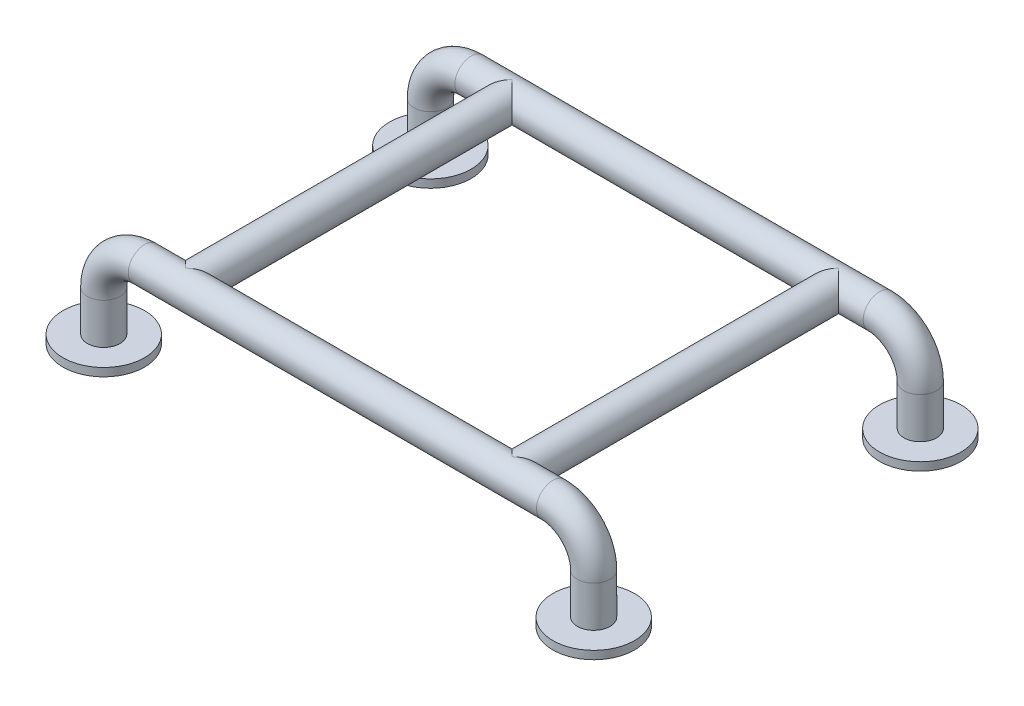
ISO-10303-21;
HEADER;
FILE_DESCRIPTION(('STEP AP214'),'2;1');
FILE_NAME('part.step','',(''),(''),'','','');
FILE_SCHEMA(('AUTOMOTIVE_DESIGN { 1 0 10303 214 1 1 1 1 }'));
ENDSEC;
DATA;
#1=APPLICATION_CONTEXT('core data for automotive mechanical design processes');
#2=APPLICATION_PROTOCOL_DEFINITION('international standard','automotive_design',2000,#1);
#3=PRODUCT_CONTEXT('',#1,'mechanical');
#4=PRODUCT('Part','Part','',(#3));
#5=PRODUCT_RELATED_PRODUCT_CATEGORY('part','',(#4));
#6=PRODUCT_DEFINITION_FORMATION('','',#4);
#7=PRODUCT_DEFINITION_CONTEXT('part definition',#1,'design');
#8=PRODUCT_DEFINITION('design','',#6,#7);
#9=PRODUCT_DEFINITION_SHAPE('','',#8);
#10=(LENGTH_UNIT() NAMED_UNIT(*) SI_UNIT(.MILLI.,.METRE.));
#11=(NAMED_UNIT(*) PLANE_ANGLE_UNIT() SI_UNIT($,.RADIAN.));
#12=(NAMED_UNIT(*) SI_UNIT($,.STERADIAN.) SOLID_ANGLE_UNIT());
#13=UNCERTAINTY_MEASURE_WITH_UNIT(LENGTH_MEASURE(1.E-05),#10,'distance_accuracy_value','');
#14=(GEOMETRIC_REPRESENTATION_CONTEXT(3) GLOBAL_UNCERTAINTY_ASSIGNED_CONTEXT((#13)) GLOBAL_UNIT_ASSIGNED_CONTEXT((#10,
#11,#12)) REPRESENTATION_CONTEXT('',''));
#15=CARTESIAN_POINT('',(0.,0.,0.));
#16=DIRECTION('',(0.,0.,1.));
#17=DIRECTION('',(1.,0.,0.));
#18=AXIS2_PLACEMENT_3D('',#15,#16,#17);
#19=CARTESIAN_POINT('',(600.,50.,400.));
#20=DIRECTION('',(0.,-1.,0.));
#21=DIRECTION('',(0.,0.,-1.));
#22=AXIS2_PLACEMENT_3D('',#19,#20,#21);
#23=CYLINDRICAL_SURFACE('',#22,20.);
#24=CARTESIAN_POINT('',(600.,50.,400.));
#25=DIRECTION('',(0.,-1.,0.));
#26=DIRECTION('',(0.,0.,1.));
#27=AXIS2_PLACEMENT_3D('',#24,#25,#26);
#28=CIRCLE('',#27,20.);
#29=CARTESIAN_POINT('',(620.,50.,400.));
#30=VERTEX_POINT('',#29);
#31=EDGE_CURVE('E11',#30,#30,#28,.T.);
#32=ORIENTED_EDGE('',*,*,#31,.T.);
#33=EDGE_LOOP('',(#32));
#34=FACE_BOUND('',#33,.T.);
#35=CARTESIAN_POINT('',(600.,0.,400.));
#36=DIRECTION('',(0.,-1.,0.));
#37=DIRECTION('',(0.,0.,-1.));
#38=AXIS2_PLACEMENT_3D('',#35,#36,#37);
#39=CIRCLE('',#38,20.);
#40=CARTESIAN_POINT('',(600.,0.,380.));
#41=VERTEX_POINT('',#40);
#42=EDGE_CURVE('E45',#41,#41,#39,.F.);
#43=ORIENTED_EDGE('',*,*,#42,.T.);
#44=EDGE_LOOP('',(#43));
#45=FACE_BOUND('',#44,.T.);
#46=ADVANCED_FACE('F41',(#34,#45),#23,.T.);
#47=CARTESIAN_POINT('',(0.,0.,400.));
#48=DIRECTION('',(0.,1.,0.));
#49=DIRECTION('',(0.,0.,1.));
#50=AXIS2_PLACEMENT_3D('',#47,#48,#49);
#51=CYLINDRICAL_SURFACE('',#50,20.);
#52=CARTESIAN_POINT('',(0.,49.9999999999997,400.));
#53=DIRECTION('',(0.,1.,0.));
#54=DIRECTION('',(0.,0.,1.));
#55=AXIS2_PLACEMENT_3D('',#52,#53,#54);
#56=CIRCLE('',#55,20.);
#57=CARTESIAN_POINT('',(-20.,49.9999999999995,400.));
#58=VERTEX_POINT('',#57);
#59=EDGE_CURVE('E58',#58,#58,#56,.T.);
#60=ORIENTED_EDGE('',*,*,#59,.F.);
#61=EDGE_LOOP('',(#60));
#62=FACE_BOUND('',#61,.T.);
#63=CARTESIAN_POINT('',(0.,0.,400.));
#64=DIRECTION('',(0.,1.,0.));
#65=DIRECTION('',(0.,0.,1.));
#66=AXIS2_PLACEMENT_3D('',#63,#64,#65);
#67=CIRCLE('',#66,20.);
#68=CARTESIAN_POINT('',(0.,0.,420.));
#69=VERTEX_POINT('',#68);
#70=EDGE_CURVE('E61',#69,#69,#67,.T.);
#71=ORIENTED_EDGE('',*,*,#70,.T.);
#72=EDGE_LOOP('',(#71));
#73=FACE_BOUND('',#72,.T.);
#74=ADVANCED_FACE('F100',(#62,#73),#51,.T.);
#75=CARTESIAN_POINT('',(50.,50.,400.));
#76=DIRECTION('',(0.,0.,-1.));
#77=DIRECTION('',(-1.,0.,0.));
#78=AXIS2_PLACEMENT_3D('',#75,#76,#77);
#79=TOROIDAL_SURFACE('',#78,50.,20.);
#80=CARTESIAN_POINT('',(50.0000000000003,100.,400.));
#81=DIRECTION('',(1.,0.,0.));
#82=DIRECTION('',(0.,0.,1.));
#83=AXIS2_PLACEMENT_3D('',#80,#81,#82);
#84=CIRCLE('',#83,20.);
#85=CARTESIAN_POINT('',(50.0000000000005,120.,400.));
#86=VERTEX_POINT('',#85);
#87=EDGE_CURVE('E53',#86,#86,#84,.T.);
#88=CARTESIAN_POINT('',(50.,50.,400.));
#89=DIRECTION('',(0.,0.,-1.));
#90=DIRECTION('',(-1.,0.,0.));
#91=AXIS2_PLACEMENT_3D('',#88,#89,#90);
#92=CIRCLE('',#91,70.);
#93=EDGE_CURVE('',#58,#86,#92,.T.);
#94=ORIENTED_EDGE('',*,*,#59,.T.);
#95=ORIENTED_EDGE('',*,*,#87,.F.);
#96=ORIENTED_EDGE('',*,*,#93,.T.);
#97=ORIENTED_EDGE('',*,*,#93,.F.);
#98=EDGE_LOOP('',(#94,#96,#95,#97));
#99=FACE_BOUND('',#98,.T.);
#100=ADVANCED_FACE('F105',(#99),#79,.T.);
#101=CARTESIAN_POINT('',(50.0000000000004,100.,400.));
#102=DIRECTION('',(1.,0.,0.));
#103=DIRECTION('',(0.,1.,0.));
#104=AXIS2_PLACEMENT_3D('',#101,#102,#103);
#105=CYLINDRICAL_SURFACE('',#104,20.);
#106=CARTESIAN_POINT('',(550.,100.,400.));
#107=DIRECTION('',(1.,0.,0.));
#108=DIRECTION('',(0.,0.,1.));
#109=AXIS2_PLACEMENT_3D('',#106,#107,#108);
#110=CIRCLE('',#109,20.);
#111=CARTESIAN_POINT('',(550.,120.,400.));
#112=VERTEX_POINT('',#111);
#113=EDGE_CURVE('E49',#112,#112,#110,.T.);
#114=ORIENTED_EDGE('',*,*,#113,.F.);
#115=EDGE_LOOP('',(#114));
#116=FACE_BOUND('',#115,.T.);
#117=ORIENTED_EDGE('',*,*,#87,.T.);
#118=EDGE_LOOP('',(#117));
#119=FACE_BOUND('',#118,.T.);
#120=ADVANCED_FACE('F111',(#116,#119),#105,.T.);
#121=CARTESIAN_POINT('',(550.,50.,400.));
#122=DIRECTION('',(0.,0.,-1.));
#123=DIRECTION('',(-1.,0.,0.));
#124=AXIS2_PLACEMENT_3D('',#121,#122,#123);
#125=TOROIDAL_SURFACE('',#124,50.,20.);
#126=CARTESIAN_POINT('',(550.,50.,400.));
#127=DIRECTION('',(0.,0.,-1.));
#128=DIRECTION('',(-1.,0.,0.));
#129=AXIS2_PLACEMENT_3D('',#126,#127,#128);
#130=CIRCLE('',#129,70.);
#131=EDGE_CURVE('',#112,#30,#130,.T.);
#132=ORIENTED_EDGE('',*,*,#113,.T.);
#133=ORIENTED_EDGE('',*,*,#31,.F.);
#134=ORIENTED_EDGE('',*,*,#131,.T.);
#135=ORIENTED_EDGE('',*,*,#131,.F.);
#136=EDGE_LOOP('',(#132,#134,#133,#135));
#137=FACE_BOUND('',#136,.T.);
#138=ADVANCED_FACE('F101',(#137),#125,.T.);
#139=CARTESIAN_POINT('',(0.,-10.,400.));
#140=DIRECTION('',(0.,1.,0.));
#141=DIRECTION('',(0.,0.,1.));
#142=AXIS2_PLACEMENT_3D('',#139,#140,#141);
#143=CYLINDRICAL_SURFACE('',#142,50.);
#144=CARTESIAN_POINT('',(0.,-10.,400.));
#145=DIRECTION('',(0.,-1.,0.));
#146=DIRECTION('',(0.,0.,-1.));
#147=AXIS2_PLACEMENT_3D('',#144,#145,#146);
#148=CIRCLE('',#147,50.);
#149=CARTESIAN_POINT('',(0.,-10.,350.));
#150=VERTEX_POINT('',#149);
#151=EDGE_CURVE('E64',#150,#150,#148,.T.);
#152=ORIENTED_EDGE('',*,*,#151,.F.);
#153=EDGE_LOOP('',(#152));
#154=FACE_BOUND('',#153,.T.);
#155=CARTESIAN_POINT('',(0.,0.,400.));
#156=DIRECTION('',(0.,-1.,0.));
#157=DIRECTION('',(0.,0.,-1.));
#158=AXIS2_PLACEMENT_3D('',#155,#156,#157);
#159=CIRCLE('',#158,50.);
#160=CARTESIAN_POINT('',(0.,0.,350.));
#161=VERTEX_POINT('',#160);
#162=EDGE_CURVE('E65',#161,#161,#159,.T.);
#163=ORIENTED_EDGE('',*,*,#162,.T.);
#164=EDGE_LOOP('',(#163));
#165=FACE_BOUND('',#164,.T.);
#166=ADVANCED_FACE('F108',(#154,#165),#143,.T.);
#167=CARTESIAN_POINT('',(0.,-10.,400.));
#168=DIRECTION('',(0.,-1.,0.));
#169=DIRECTION('',(0.,0.,-1.));
#170=AXIS2_PLACEMENT_3D('',#167,#168,#169);
#171=PLANE('',#170);
#172=ORIENTED_EDGE('',*,*,#151,.T.);
#173=EDGE_LOOP('',(#172));
#174=FACE_BOUND('',#173,.T.);
#175=ADVANCED_FACE('F95',(#174),#171,.T.);
#176=CARTESIAN_POINT('',(0.,0.,400.));
#177=DIRECTION('',(0.,-1.,0.));
#178=DIRECTION('',(0.,0.,-1.));
#179=AXIS2_PLACEMENT_3D('',#176,#177,#178);
#180=PLANE('',#179);
#181=ORIENTED_EDGE('',*,*,#70,.F.);
#182=EDGE_LOOP('',(#181));
#183=FACE_BOUND('',#182,.T.);
#184=ORIENTED_EDGE('',*,*,#162,.F.);
#185=EDGE_LOOP('',(#184));
#186=FACE_BOUND('',#185,.T.);
#187=ADVANCED_FACE('F89',(#183,#186),#180,.F.);
#188=CARTESIAN_POINT('',(600.,-10.,400.));
#189=DIRECTION('',(0.,1.,0.));
#190=DIRECTION('',(0.,0.,1.));
#191=AXIS2_PLACEMENT_3D('',#188,#189,#190);
#192=CYLINDRICAL_SURFACE('',#191,50.);
#193=CARTESIAN_POINT('',(600.,-10.,400.));
#194=DIRECTION('',(0.,-1.,0.));
#195=DIRECTION('',(0.,0.,-1.));
#196=AXIS2_PLACEMENT_3D('',#193,#194,#195);
#197=CIRCLE('',#196,50.);
#198=CARTESIAN_POINT('',(600.,-10.,350.));
#199=VERTEX_POINT('',#198);
#200=EDGE_CURVE('E73',#199,#199,#197,.T.);
#201=ORIENTED_EDGE('',*,*,#200,.F.);
#202=EDGE_LOOP('',(#201));
#203=FACE_BOUND('',#202,.T.);
#204=CARTESIAN_POINT('',(600.,0.,400.));
#205=DIRECTION('',(0.,-1.,0.));
#206=DIRECTION('',(0.,0.,-1.));
#207=AXIS2_PLACEMENT_3D('',#204,#205,#206);
#208=CIRCLE('',#207,50.);
#209=CARTESIAN_POINT('',(600.,0.,350.));
#210=VERTEX_POINT('',#209);
#211=EDGE_CURVE('E70',#210,#210,#208,.T.);
#212=ORIENTED_EDGE('',*,*,#211,.T.);
#213=EDGE_LOOP('',(#212));
#214=FACE_BOUND('',#213,.T.);
#215=ADVANCED_FACE('F84',(#203,#214),#192,.T.);
#216=CARTESIAN_POINT('',(600.,0.,400.));
#217=DIRECTION('',(0.,-1.,0.));
#218=DIRECTION('',(0.,0.,-1.));
#219=AXIS2_PLACEMENT_3D('',#216,#217,#218);
#220=PLANE('',#219);
#221=ORIENTED_EDGE('',*,*,#42,.F.);
#222=EDGE_LOOP('',(#221));
#223=FACE_BOUND('',#222,.T.);
#224=ORIENTED_EDGE('',*,*,#211,.F.);
#225=EDGE_LOOP('',(#224));
#226=FACE_BOUND('',#225,.T.);
#227=ADVANCED_FACE('F81',(#223,#226),#220,.F.);
#228=CARTESIAN_POINT('',(600.,-9.99999999999999,400.));
#229=DIRECTION('',(0.,-1.,0.));
#230=DIRECTION('',(0.,0.,1.));
#231=AXIS2_PLACEMENT_3D('',#228,#229,#230);
#232=PLANE('',#231);
#233=ORIENTED_EDGE('',*,*,#200,.T.);
#234=EDGE_LOOP('',(#233));
#235=FACE_BOUND('',#234,.T.);
#236=ADVANCED_FACE('F43',(#235),#232,.T.);
#237=CLOSED_SHELL('',(#46,#74,#100,#120,#138,#166,#175,#187,#215,#227,#236));
#238=MANIFOLD_SOLID_BREP('B2',#237);
#239=CARTESIAN_POINT('',(50.0000000000004,100.,0.));
#240=DIRECTION('',(1.,0.,0.));
#241=DIRECTION('',(0.,1.,0.));
#242=AXIS2_PLACEMENT_3D('',#239,#240,#241);
#243=CYLINDRICAL_SURFACE('',#242,20.);
#244=CARTESIAN_POINT('',(550.,100.,0.));
#245=DIRECTION('',(1.,0.,0.));
#246=DIRECTION('',(0.,0.,1.));
#247=AXIS2_PLACEMENT_3D('',#244,#245,#246);
#248=CIRCLE('',#247,20.);
#249=CARTESIAN_POINT('',(550.,120.,0.));
#250=VERTEX_POINT('',#249);
#251=EDGE_CURVE('E264',#250,#250,#248,.T.);
#252=ORIENTED_EDGE('',*,*,#251,.F.);
#253=EDGE_LOOP('',(#252));
#254=FACE_BOUND('',#253,.T.);
#255=CARTESIAN_POINT('',(50.0000000000003,100.,0.));
#256=DIRECTION('',(1.,0.,0.));
#257=DIRECTION('',(0.,0.,1.));
#258=AXIS2_PLACEMENT_3D('',#255,#256,#257);
#259=CIRCLE('',#258,20.);
#260=CARTESIAN_POINT('',(50.0000000000005,120.,0.));
#261=VERTEX_POINT('',#260);
#262=EDGE_CURVE('E269',#261,#261,#259,.T.);
#263=ORIENTED_EDGE('',*,*,#262,.T.);
#264=EDGE_LOOP('',(#263));
#265=FACE_BOUND('',#264,.T.);
#266=CARTESIAN_POINT('',(100.,100.,0.));
#267=DIRECTION('',(0.707106781186547,0.,0.707106781186547));
#268=DIRECTION('',(0.707106781186547,0.,-0.707106781186547));
#269=AXIS2_PLACEMENT_3D('',#266,#267,#268);
#270=ELLIPSE('',#269,28.2842712474619,20.);
#271=CARTESIAN_POINT('',(100.,80.,0.));
#272=VERTEX_POINT('',#271);
#273=CARTESIAN_POINT('',(100.,120.,0.));
#274=VERTEX_POINT('',#273);
#275=EDGE_CURVE('E266',#272,#274,#270,.F.);
#276=ORIENTED_EDGE('',*,*,#275,.T.);
#277=CARTESIAN_POINT('',(100.,100.,0.));
#278=DIRECTION('',(0.707106781186547,0.,-0.707106781186547));
#279=DIRECTION('',(0.707106781186547,0.,0.707106781186547));
#280=AXIS2_PLACEMENT_3D('',#277,#278,#279);
#281=ELLIPSE('',#280,28.2842712474619,20.);
#282=EDGE_CURVE('E224',#274,#272,#281,.T.);
#283=ORIENTED_EDGE('',*,*,#282,.T.);
#284=EDGE_LOOP('',(#276,#283));
#285=FACE_BOUND('',#284,.T.);
#286=CARTESIAN_POINT('',(500.,100.,0.));
#287=DIRECTION('',(0.707106781186547,0.,0.707106781186547));
#288=DIRECTION('',(0.707106781186547,0.,-0.707106781186547));
#289=AXIS2_PLACEMENT_3D('',#286,#287,#288);
#290=ELLIPSE('',#289,28.2842712474619,20.);
#291=CARTESIAN_POINT('',(500.,80.,0.));
#292=VERTEX_POINT('',#291);
#293=CARTESIAN_POINT('',(500.,120.,0.));
#294=VERTEX_POINT('',#293);
#295=EDGE_CURVE('E213',#292,#294,#290,.F.);
#296=ORIENTED_EDGE('',*,*,#295,.T.);
#297=CARTESIAN_POINT('',(500.,100.,0.));
#298=DIRECTION('',(0.707106781186547,0.,-0.707106781186547));
#299=DIRECTION('',(0.707106781186547,0.,0.707106781186547));
#300=AXIS2_PLACEMENT_3D('',#297,#298,#299);
#301=ELLIPSE('',#300,28.2842712474619,20.);
#302=EDGE_CURVE('E39',#294,#292,#301,.T.);
#303=ORIENTED_EDGE('',*,*,#302,.T.);
#304=EDGE_LOOP('',(#296,#303));
#305=FACE_BOUND('',#304,.T.);
#306=ADVANCED_FACE('F205',(#254,#265,#285,#305),#243,.T.);
#307=CARTESIAN_POINT('',(0.,0.,0.));
#308=DIRECTION('',(0.,1.,0.));
#309=DIRECTION('',(0.,0.,1.));
#310=AXIS2_PLACEMENT_3D('',#307,#308,#309);
#311=CYLINDRICAL_SURFACE('',#310,20.);
#312=CARTESIAN_POINT('',(0.,49.9999999999997,0.));
#313=DIRECTION('',(0.,1.,0.));
#314=DIRECTION('',(0.,0.,1.));
#315=AXIS2_PLACEMENT_3D('',#312,#313,#314);
#316=CIRCLE('',#315,20.);
#317=CARTESIAN_POINT('',(-20.,49.9999999999995,0.));
#318=VERTEX_POINT('',#317);
#319=EDGE_CURVE('E305',#318,#318,#316,.T.);
#320=ORIENTED_EDGE('',*,*,#319,.F.);
#321=EDGE_LOOP('',(#320));
#322=FACE_BOUND('',#321,.T.);
#323=CARTESIAN_POINT('',(0.,0.,0.));
#324=DIRECTION('',(0.,1.,0.));
#325=DIRECTION('',(0.,0.,1.));
#326=AXIS2_PLACEMENT_3D('',#323,#324,#325);
#327=CIRCLE('',#326,20.);
#328=CARTESIAN_POINT('',(0.,0.,20.));
#329=VERTEX_POINT('',#328);
#330=EDGE_CURVE('E300',#329,#329,#327,.T.);
#331=ORIENTED_EDGE('',*,*,#330,.T.);
#332=EDGE_LOOP('',(#331));
#333=FACE_BOUND('',#332,.T.);
#334=ADVANCED_FACE('F233',(#322,#333),#311,.T.);
#335=CARTESIAN_POINT('',(50.,50.,0.));
#336=DIRECTION('',(0.,0.,-1.));
#337=DIRECTION('',(-1.,0.,0.));
#338=AXIS2_PLACEMENT_3D('',#335,#336,#337);
#339=TOROIDAL_SURFACE('',#338,50.,20.);
#340=CARTESIAN_POINT('',(50.,50.,0.));
#341=DIRECTION('',(0.,0.,-1.));
#342=DIRECTION('',(-1.,0.,0.));
#343=AXIS2_PLACEMENT_3D('',#340,#341,#342);
#344=CIRCLE('',#343,70.);
#345=EDGE_CURVE('',#318,#261,#344,.T.);
#346=ORIENTED_EDGE('',*,*,#319,.T.);
#347=ORIENTED_EDGE('',*,*,#262,.F.);
#348=ORIENTED_EDGE('',*,*,#345,.T.);
#349=ORIENTED_EDGE('',*,*,#345,.F.);
#350=EDGE_LOOP('',(#346,#348,#347,#349));
#351=FACE_BOUND('',#350,.T.);
#352=ADVANCED_FACE('F239',(#351),#339,.T.);
#353=CARTESIAN_POINT('',(550.,50.,0.));
#354=DIRECTION('',(0.,0.,-1.));
#355=DIRECTION('',(-1.,0.,0.));
#356=AXIS2_PLACEMENT_3D('',#353,#354,#355);
#357=TOROIDAL_SURFACE('',#356,50.,20.);
#358=CARTESIAN_POINT('',(600.,50.,0.));
#359=DIRECTION('',(0.,-1.,0.));
#360=DIRECTION('',(0.,0.,1.));
#361=AXIS2_PLACEMENT_3D('',#358,#359,#360);
#362=CIRCLE('',#361,20.);
#363=CARTESIAN_POINT('',(620.,50.,0.));
#364=VERTEX_POINT('',#363);
#365=EDGE_CURVE('E263',#364,#364,#362,.T.);
#366=CARTESIAN_POINT('',(550.,50.,0.));
#367=DIRECTION('',(0.,0.,-1.));
#368=DIRECTION('',(-1.,0.,0.));
#369=AXIS2_PLACEMENT_3D('',#366,#367,#368);
#370=CIRCLE('',#369,70.);
#371=EDGE_CURVE('',#250,#364,#370,.T.);
#372=ORIENTED_EDGE('',*,*,#251,.T.);
#373=ORIENTED_EDGE('',*,*,#365,.F.);
#374=ORIENTED_EDGE('',*,*,#371,.T.);
#375=ORIENTED_EDGE('',*,*,#371,.F.);
#376=EDGE_LOOP('',(#372,#374,#373,#375));
#377=FACE_BOUND('',#376,.T.);
#378=ADVANCED_FACE('F247',(#377),#357,.T.);
#379=CARTESIAN_POINT('',(600.,50.,0.));
#380=DIRECTION('',(0.,-1.,0.));
#381=DIRECTION('',(1.,0.,0.));
#382=AXIS2_PLACEMENT_3D('',#379,#380,#381);
#383=CYLINDRICAL_SURFACE('',#382,20.);
#384=CARTESIAN_POINT('',(600.,0.,0.));
#385=DIRECTION('',(0.,-1.,0.));
#386=DIRECTION('',(0.,0.,1.));
#387=AXIS2_PLACEMENT_3D('',#384,#385,#386);
#388=CIRCLE('',#387,20.);
#389=CARTESIAN_POINT('',(600.,0.,20.));
#390=VERTEX_POINT('',#389);
#391=EDGE_CURVE('E260',#390,#390,#388,.T.);
#392=ORIENTED_EDGE('',*,*,#391,.F.);
#393=EDGE_LOOP('',(#392));
#394=FACE_BOUND('',#393,.T.);
#395=ORIENTED_EDGE('',*,*,#365,.T.);
#396=EDGE_LOOP('',(#395));
#397=FACE_BOUND('',#396,.T.);
#398=ADVANCED_FACE('F207',(#394,#397),#383,.T.);
#399=CARTESIAN_POINT('',(0.,-10.,0.));
#400=DIRECTION('',(0.,1.,0.));
#401=DIRECTION('',(0.,0.,1.));
#402=AXIS2_PLACEMENT_3D('',#399,#400,#401);
#403=CYLINDRICAL_SURFACE('',#402,50.);
#404=CARTESIAN_POINT('',(0.,-10.,0.));
#405=DIRECTION('',(0.,-1.,0.));
#406=DIRECTION('',(0.,0.,-1.));
#407=AXIS2_PLACEMENT_3D('',#404,#405,#406);
#408=CIRCLE('',#407,50.);
#409=CARTESIAN_POINT('',(0.,-10.,-50.));
#410=VERTEX_POINT('',#409);
#411=EDGE_CURVE('E297',#410,#410,#408,.T.);
#412=ORIENTED_EDGE('',*,*,#411,.F.);
#413=EDGE_LOOP('',(#412));
#414=FACE_BOUND('',#413,.T.);
#415=CARTESIAN_POINT('',(0.,0.,0.));
#416=DIRECTION('',(0.,-1.,0.));
#417=DIRECTION('',(0.,0.,-1.));
#418=AXIS2_PLACEMENT_3D('',#415,#416,#417);
#419=CIRCLE('',#418,50.);
#420=CARTESIAN_POINT('',(0.,0.,-50.));
#421=VERTEX_POINT('',#420);
#422=EDGE_CURVE('E295',#421,#421,#419,.T.);
#423=ORIENTED_EDGE('',*,*,#422,.T.);
#424=EDGE_LOOP('',(#423));
#425=FACE_BOUND('',#424,.T.);
#426=ADVANCED_FACE('F242',(#414,#425),#403,.T.);
#427=CARTESIAN_POINT('',(0.,-10.,0.));
#428=DIRECTION('',(0.,-1.,0.));
#429=DIRECTION('',(0.,0.,-1.));
#430=AXIS2_PLACEMENT_3D('',#427,#428,#429);
#431=PLANE('',#430);
#432=ORIENTED_EDGE('',*,*,#411,.T.);
#433=EDGE_LOOP('',(#432));
#434=FACE_BOUND('',#433,.T.);
#435=ADVANCED_FACE('F253',(#434),#431,.T.);
#436=CARTESIAN_POINT('',(0.,0.,0.));
#437=DIRECTION('',(0.,-1.,0.));
#438=DIRECTION('',(0.,0.,-1.));
#439=AXIS2_PLACEMENT_3D('',#436,#437,#438);
#440=PLANE('',#439);
#441=ORIENTED_EDGE('',*,*,#330,.F.);
#442=EDGE_LOOP('',(#441));
#443=FACE_BOUND('',#442,.T.);
#444=ORIENTED_EDGE('',*,*,#422,.F.);
#445=EDGE_LOOP('',(#444));
#446=FACE_BOUND('',#445,.T.);
#447=ADVANCED_FACE('F316',(#443,#446),#440,.F.);
#448=CARTESIAN_POINT('',(600.,-10.,0.));
#449=DIRECTION('',(0.,1.,0.));
#450=DIRECTION('',(0.,0.,1.));
#451=AXIS2_PLACEMENT_3D('',#448,#449,#450);
#452=CYLINDRICAL_SURFACE('',#451,50.);
#453=CARTESIAN_POINT('',(600.,-10.,0.));
#454=DIRECTION('',(0.,-1.,0.));
#455=DIRECTION('',(0.,0.,-1.));
#456=AXIS2_PLACEMENT_3D('',#453,#454,#455);
#457=CIRCLE('',#456,50.);
#458=CARTESIAN_POINT('',(600.,-10.,-50.));
#459=VERTEX_POINT('',#458);
#460=EDGE_CURVE('E289',#459,#459,#457,.T.);
#461=ORIENTED_EDGE('',*,*,#460,.F.);
#462=EDGE_LOOP('',(#461));
#463=FACE_BOUND('',#462,.T.);
#464=CARTESIAN_POINT('',(600.,0.,0.));
#465=DIRECTION('',(0.,-1.,0.));
#466=DIRECTION('',(0.,0.,-1.));
#467=AXIS2_PLACEMENT_3D('',#464,#465,#466);
#468=CIRCLE('',#467,50.);
#469=CARTESIAN_POINT('',(600.,0.,-50.));
#470=VERTEX_POINT('',#469);
#471=EDGE_CURVE('E285',#470,#470,#468,.T.);
#472=ORIENTED_EDGE('',*,*,#471,.T.);
#473=EDGE_LOOP('',(#472));
#474=FACE_BOUND('',#473,.T.);
#475=ADVANCED_FACE('F319',(#463,#474),#452,.T.);
#476=CARTESIAN_POINT('',(600.,-10.,0.));
#477=DIRECTION('',(0.,-1.,0.));
#478=DIRECTION('',(0.,0.,-1.));
#479=AXIS2_PLACEMENT_3D('',#476,#477,#478);
#480=PLANE('',#479);
#481=ORIENTED_EDGE('',*,*,#460,.T.);
#482=EDGE_LOOP('',(#481));
#483=FACE_BOUND('',#482,.T.);
#484=ADVANCED_FACE('F327',(#483),#480,.T.);
#485=CARTESIAN_POINT('',(600.,0.,0.));
#486=DIRECTION('',(0.,-1.,0.));
#487=DIRECTION('',(0.,0.,-1.));
#488=AXIS2_PLACEMENT_3D('',#485,#486,#487);
#489=PLANE('',#488);
#490=ORIENTED_EDGE('',*,*,#391,.T.);
#491=EDGE_LOOP('',(#490));
#492=FACE_BOUND('',#491,.T.);
#493=ORIENTED_EDGE('',*,*,#471,.F.);
#494=EDGE_LOOP('',(#493));
#495=FACE_BOUND('',#494,.T.);
#496=ADVANCED_FACE('F279',(#492,#495),#489,.F.);
#497=CARTESIAN_POINT('',(100.,100.,400.));
#498=DIRECTION('',(0.,0.,-1.));
#499=DIRECTION('',(-1.,0.,0.));
#500=AXIS2_PLACEMENT_3D('',#497,#498,#499);
#501=CYLINDRICAL_SURFACE('',#500,20.);
#502=ORIENTED_EDGE('',*,*,#282,.F.);
#503=ORIENTED_EDGE('',*,*,#275,.F.);
#504=EDGE_LOOP('',(#502,#503));
#505=FACE_BOUND('',#504,.T.);
#506=CARTESIAN_POINT('',(100.,100.,400.));
#507=DIRECTION('',(0.,0.,1.));
#508=DIRECTION('',(1.,0.,0.));
#509=AXIS2_PLACEMENT_3D('',#506,#507,#508);
#510=CIRCLE('',#509,20.);
#511=CARTESIAN_POINT('',(120.,100.,400.));
#512=VERTEX_POINT('',#511);
#513=EDGE_CURVE('E283',#512,#512,#510,.T.);
#514=ORIENTED_EDGE('',*,*,#513,.F.);
#515=EDGE_LOOP('',(#514));
#516=FACE_BOUND('',#515,.T.);
#517=ADVANCED_FACE('F275',(#505,#516),#501,.T.);
#518=CARTESIAN_POINT('',(100.,100.,400.));
#519=DIRECTION('',(0.,0.,1.));
#520=DIRECTION('',(1.,0.,0.));
#521=AXIS2_PLACEMENT_3D('',#518,#519,#520);
#522=PLANE('',#521);
#523=ORIENTED_EDGE('',*,*,#513,.T.);
#524=EDGE_LOOP('',(#523));
#525=FACE_BOUND('',#524,.T.);
#526=ADVANCED_FACE('F278',(#525),#522,.T.);
#527=CARTESIAN_POINT('',(500.,100.,400.));
#528=DIRECTION('',(0.,0.,-1.));
#529=DIRECTION('',(-1.,0.,0.));
#530=AXIS2_PLACEMENT_3D('',#527,#528,#529);
#531=CYLINDRICAL_SURFACE('',#530,20.);
#532=ORIENTED_EDGE('',*,*,#302,.F.);
#533=ORIENTED_EDGE('',*,*,#295,.F.);
#534=EDGE_LOOP('',(#532,#533));
#535=FACE_BOUND('',#534,.T.);
#536=CARTESIAN_POINT('',(500.,100.,400.));
#537=DIRECTION('',(0.,0.,1.));
#538=DIRECTION('',(1.,0.,0.));
#539=AXIS2_PLACEMENT_3D('',#536,#537,#538);
#540=CIRCLE('',#539,20.);
#541=CARTESIAN_POINT('',(520.,100.,400.));
#542=VERTEX_POINT('',#541);
#543=EDGE_CURVE('E286',#542,#542,#540,.T.);
#544=ORIENTED_EDGE('',*,*,#543,.F.);
#545=EDGE_LOOP('',(#544));
#546=FACE_BOUND('',#545,.T.);
#547=ADVANCED_FACE('F229',(#535,#546),#531,.T.);
#548=CARTESIAN_POINT('',(500.,100.,400.));
#549=DIRECTION('',(0.,0.,1.));
#550=DIRECTION('',(1.,0.,0.));
#551=AXIS2_PLACEMENT_3D('',#548,#549,#550);
#552=PLANE('',#551);
#553=ORIENTED_EDGE('',*,*,#543,.T.);
#554=EDGE_LOOP('',(#553));
#555=FACE_BOUND('',#554,.T.);
#556=ADVANCED_FACE('F343',(#555),#552,.T.);
#557=CLOSED_SHELL('',(#306,#334,#352,#378,#398,#426,#435,#447,#475,#484,#496,#517,#526,#547,#556));
#558=MANIFOLD_SOLID_BREP('B6',#557);
#559=ADVANCED_BREP_SHAPE_REPRESENTATION('',(#18,#238,#558),#14);
#560=SHAPE_DEFINITION_REPRESENTATION(#9,#559);
ENDSEC;
END-ISO-10303-21;
